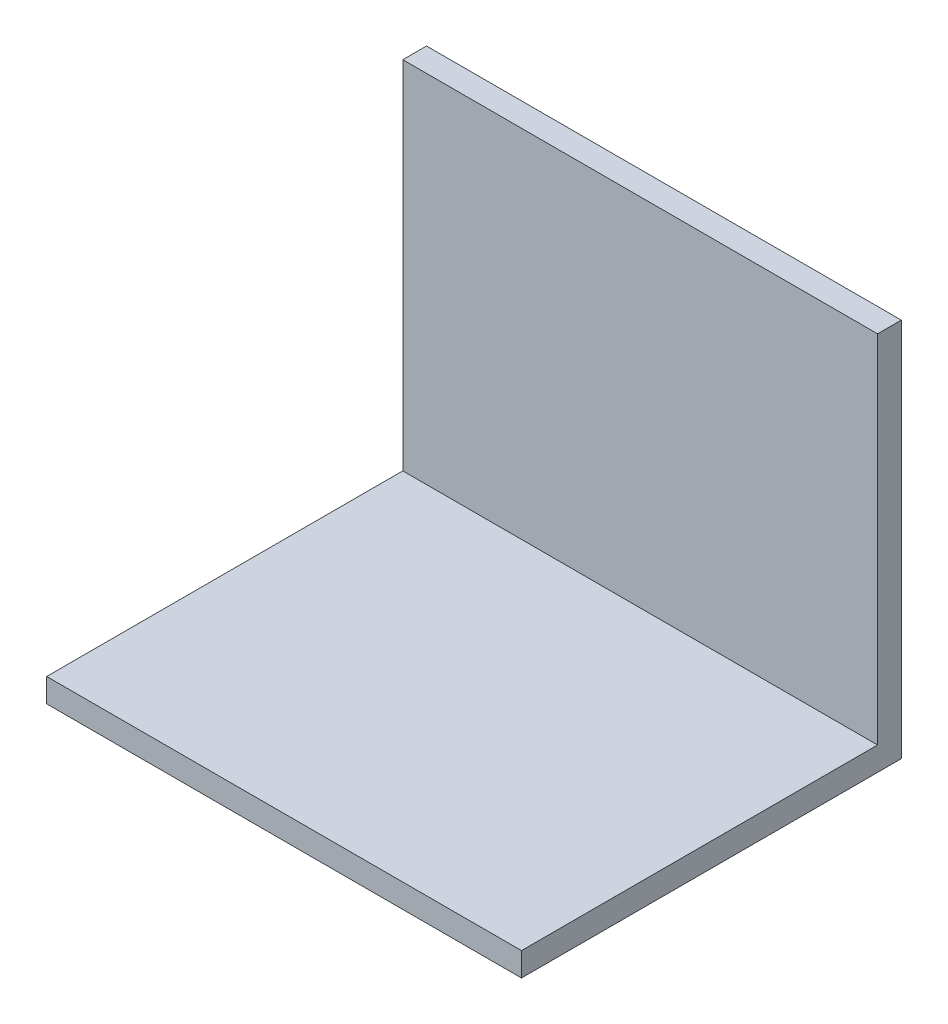
ISO-10303-21;
HEADER;
FILE_DESCRIPTION(('STEP AP214'),'2;1');
FILE_NAME('part.step','',(''),(''),'','','');
FILE_SCHEMA(('AUTOMOTIVE_DESIGN { 1 0 10303 214 1 1 1 1 }'));
ENDSEC;
DATA;
#1=APPLICATION_CONTEXT('core data for automotive mechanical design processes');
#2=APPLICATION_PROTOCOL_DEFINITION('international standard','automotive_design',2000,#1);
#3=PRODUCT_CONTEXT('',#1,'mechanical');
#4=PRODUCT('Part','Part','',(#3));
#5=PRODUCT_RELATED_PRODUCT_CATEGORY('part','',(#4));
#6=PRODUCT_DEFINITION_FORMATION('','',#4);
#7=PRODUCT_DEFINITION_CONTEXT('part definition',#1,'design');
#8=PRODUCT_DEFINITION('design','',#6,#7);
#9=PRODUCT_DEFINITION_SHAPE('','',#8);
#10=(LENGTH_UNIT() NAMED_UNIT(*) SI_UNIT(.MILLI.,.METRE.));
#11=(NAMED_UNIT(*) PLANE_ANGLE_UNIT() SI_UNIT($,.RADIAN.));
#12=(NAMED_UNIT(*) SI_UNIT($,.STERADIAN.) SOLID_ANGLE_UNIT());
#13=UNCERTAINTY_MEASURE_WITH_UNIT(LENGTH_MEASURE(1.E-05),#10,'distance_accuracy_value','');
#14=(GEOMETRIC_REPRESENTATION_CONTEXT(3) GLOBAL_UNCERTAINTY_ASSIGNED_CONTEXT((#13)) GLOBAL_UNIT_ASSIGNED_CONTEXT((#10,
#11,#12)) REPRESENTATION_CONTEXT('',''));
#15=CARTESIAN_POINT('',(0.,0.,0.));
#16=DIRECTION('',(0.,0.,1.));
#17=DIRECTION('',(1.,0.,0.));
#18=AXIS2_PLACEMENT_3D('',#15,#16,#17);
#19=CARTESIAN_POINT('',(127.,0.,0.));
#20=DIRECTION('',(0.,0.,1.));
#21=DIRECTION('',(1.,0.,0.));
#22=AXIS2_PLACEMENT_3D('',#19,#20,#21);
#23=PLANE('',#22);
#24=DIRECTION('',(0.,1.,0.));
#25=VECTOR('',#24,1.);
#26=CARTESIAN_POINT('',(0.,0.,0.));
#27=LINE('',#26,#25);
#28=CARTESIAN_POINT('',(0.,0.,0.));
#29=VERTEX_POINT('',#28);
#30=CARTESIAN_POINT('',(0.,101.6,0.));
#31=VERTEX_POINT('',#30);
#32=EDGE_CURVE('E118',#29,#31,#27,.T.);
#33=ORIENTED_EDGE('',*,*,#32,.T.);
#34=DIRECTION('',(-1.,0.,0.));
#35=VECTOR('',#34,1.);
#36=CARTESIAN_POINT('',(127.,101.6,0.));
#37=LINE('',#36,#35);
#38=CARTESIAN_POINT('',(127.,101.6,0.));
#39=VERTEX_POINT('',#38);
#40=EDGE_CURVE('E11',#39,#31,#37,.T.);
#41=ORIENTED_EDGE('',*,*,#40,.F.);
#42=DIRECTION('',(0.,1.,0.));
#43=VECTOR('',#42,1.);
#44=CARTESIAN_POINT('',(127.,0.,0.));
#45=LINE('',#44,#43);
#46=CARTESIAN_POINT('',(127.,0.,0.));
#47=VERTEX_POINT('',#46);
#48=EDGE_CURVE('E128',#47,#39,#45,.T.);
#49=ORIENTED_EDGE('',*,*,#48,.F.);
#50=DIRECTION('',(-1.,0.,0.));
#51=VECTOR('',#50,1.);
#52=CARTESIAN_POINT('',(127.,0.,0.));
#53=LINE('',#52,#51);
#54=EDGE_CURVE('E114',#47,#29,#53,.T.);
#55=ORIENTED_EDGE('',*,*,#54,.T.);
#56=EDGE_LOOP('',(#33,#41,#49,#55));
#57=FACE_BOUND('',#56,.T.);
#58=ADVANCED_FACE('F34',(#57),#23,.F.);
#59=CARTESIAN_POINT('',(127.,101.6,0.));
#60=DIRECTION('',(0.,-1.,0.));
#61=DIRECTION('',(0.,0.,-1.));
#62=AXIS2_PLACEMENT_3D('',#59,#60,#61);
#63=PLANE('',#62);
#64=DIRECTION('',(0.,0.,1.));
#65=VECTOR('',#64,1.);
#66=CARTESIAN_POINT('',(0.,101.6,0.));
#67=LINE('',#66,#65);
#68=CARTESIAN_POINT('',(0.,101.6,6.35));
#69=VERTEX_POINT('',#68);
#70=EDGE_CURVE('E121',#31,#69,#67,.T.);
#71=ORIENTED_EDGE('',*,*,#70,.T.);
#72=DIRECTION('',(-1.,0.,0.));
#73=VECTOR('',#72,1.);
#74=CARTESIAN_POINT('',(127.,101.6,6.35));
#75=LINE('',#74,#73);
#76=CARTESIAN_POINT('',(127.,101.6,6.35));
#77=VERTEX_POINT('',#76);
#78=EDGE_CURVE('E42',#77,#69,#75,.T.);
#79=ORIENTED_EDGE('',*,*,#78,.F.);
#80=DIRECTION('',(0.,0.,1.));
#81=VECTOR('',#80,1.);
#82=CARTESIAN_POINT('',(127.,101.6,0.));
#83=LINE('',#82,#81);
#84=EDGE_CURVE('E87',#39,#77,#83,.T.);
#85=ORIENTED_EDGE('',*,*,#84,.F.);
#86=ORIENTED_EDGE('',*,*,#40,.T.);
#87=EDGE_LOOP('',(#71,#79,#85,#86));
#88=FACE_BOUND('',#87,.T.);
#89=ADVANCED_FACE('F152',(#88),#63,.F.);
#90=CARTESIAN_POINT('',(127.,6.35,6.35));
#91=DIRECTION('',(0.,0.,-1.));
#92=DIRECTION('',(-1.,0.,0.));
#93=AXIS2_PLACEMENT_3D('',#90,#91,#92);
#94=PLANE('',#93);
#95=DIRECTION('',(0.,-1.,0.));
#96=VECTOR('',#95,1.);
#97=CARTESIAN_POINT('',(0.,6.35,6.35));
#98=LINE('',#97,#96);
#99=CARTESIAN_POINT('',(0.,6.35,6.35));
#100=VERTEX_POINT('',#99);
#101=EDGE_CURVE('E123',#69,#100,#98,.T.);
#102=ORIENTED_EDGE('',*,*,#101,.T.);
#103=DIRECTION('',(-1.,0.,0.));
#104=VECTOR('',#103,1.);
#105=CARTESIAN_POINT('',(127.,6.35,6.35));
#106=LINE('',#105,#104);
#107=CARTESIAN_POINT('',(127.,6.35,6.35));
#108=VERTEX_POINT('',#107);
#109=EDGE_CURVE('E109',#108,#100,#106,.T.);
#110=ORIENTED_EDGE('',*,*,#109,.F.);
#111=DIRECTION('',(0.,-1.,0.));
#112=VECTOR('',#111,1.);
#113=CARTESIAN_POINT('',(127.,6.35,6.35));
#114=LINE('',#113,#112);
#115=EDGE_CURVE('E100',#77,#108,#114,.T.);
#116=ORIENTED_EDGE('',*,*,#115,.F.);
#117=ORIENTED_EDGE('',*,*,#78,.T.);
#118=EDGE_LOOP('',(#102,#110,#116,#117));
#119=FACE_BOUND('',#118,.T.);
#120=ADVANCED_FACE('F134',(#119),#94,.F.);
#121=CARTESIAN_POINT('',(127.,6.35,6.35));
#122=DIRECTION('',(0.,-1.,0.));
#123=DIRECTION('',(0.,0.,-1.));
#124=AXIS2_PLACEMENT_3D('',#121,#122,#123);
#125=PLANE('',#124);
#126=DIRECTION('',(0.,0.,1.));
#127=VECTOR('',#126,1.);
#128=CARTESIAN_POINT('',(0.,6.35,6.35));
#129=LINE('',#128,#127);
#130=CARTESIAN_POINT('',(0.,6.34999999999999,101.6));
#131=VERTEX_POINT('',#130);
#132=EDGE_CURVE('E108',#100,#131,#129,.T.);
#133=ORIENTED_EDGE('',*,*,#132,.T.);
#134=DIRECTION('',(-1.,0.,0.));
#135=VECTOR('',#134,1.);
#136=CARTESIAN_POINT('',(127.,6.34999999999999,101.6));
#137=LINE('',#136,#135);
#138=CARTESIAN_POINT('',(127.,6.34999999999999,101.6));
#139=VERTEX_POINT('',#138);
#140=EDGE_CURVE('E105',#139,#131,#137,.T.);
#141=ORIENTED_EDGE('',*,*,#140,.F.);
#142=DIRECTION('',(0.,0.,1.));
#143=VECTOR('',#142,1.);
#144=CARTESIAN_POINT('',(127.,6.35,6.35));
#145=LINE('',#144,#143);
#146=EDGE_CURVE('E94',#108,#139,#145,.T.);
#147=ORIENTED_EDGE('',*,*,#146,.F.);
#148=ORIENTED_EDGE('',*,*,#109,.T.);
#149=EDGE_LOOP('',(#133,#141,#147,#148));
#150=FACE_BOUND('',#149,.T.);
#151=ADVANCED_FACE('F106',(#150),#125,.F.);
#152=CARTESIAN_POINT('',(127.,0.,101.6));
#153=DIRECTION('',(0.,0.,-1.));
#154=DIRECTION('',(-1.,0.,0.));
#155=AXIS2_PLACEMENT_3D('',#152,#153,#154);
#156=PLANE('',#155);
#157=DIRECTION('',(0.,-1.,0.));
#158=VECTOR('',#157,1.);
#159=CARTESIAN_POINT('',(0.,0.,101.6));
#160=LINE('',#159,#158);
#161=CARTESIAN_POINT('',(0.,0.,101.6));
#162=VERTEX_POINT('',#161);
#163=EDGE_CURVE('E73',#131,#162,#160,.T.);
#164=ORIENTED_EDGE('',*,*,#163,.T.);
#165=DIRECTION('',(-1.,0.,0.));
#166=VECTOR('',#165,1.);
#167=CARTESIAN_POINT('',(127.,0.,101.6));
#168=LINE('',#167,#166);
#169=CARTESIAN_POINT('',(127.,0.,101.6));
#170=VERTEX_POINT('',#169);
#171=EDGE_CURVE('E110',#170,#162,#168,.T.);
#172=ORIENTED_EDGE('',*,*,#171,.F.);
#173=DIRECTION('',(0.,-1.,0.));
#174=VECTOR('',#173,1.);
#175=CARTESIAN_POINT('',(127.,0.,101.6));
#176=LINE('',#175,#174);
#177=EDGE_CURVE('E98',#139,#170,#176,.T.);
#178=ORIENTED_EDGE('',*,*,#177,.F.);
#179=ORIENTED_EDGE('',*,*,#140,.T.);
#180=EDGE_LOOP('',(#164,#172,#178,#179));
#181=FACE_BOUND('',#180,.T.);
#182=ADVANCED_FACE('F112',(#181),#156,.F.);
#183=CARTESIAN_POINT('',(127.,0.,0.));
#184=DIRECTION('',(0.,1.,0.));
#185=DIRECTION('',(0.,0.,1.));
#186=AXIS2_PLACEMENT_3D('',#183,#184,#185);
#187=PLANE('',#186);
#188=DIRECTION('',(0.,0.,-1.));
#189=VECTOR('',#188,1.);
#190=CARTESIAN_POINT('',(0.,0.,0.));
#191=LINE('',#190,#189);
#192=EDGE_CURVE('E79',#162,#29,#191,.T.);
#193=ORIENTED_EDGE('',*,*,#192,.T.);
#194=ORIENTED_EDGE('',*,*,#54,.F.);
#195=DIRECTION('',(0.,0.,-1.));
#196=VECTOR('',#195,1.);
#197=CARTESIAN_POINT('',(127.,0.,0.));
#198=LINE('',#197,#196);
#199=EDGE_CURVE('E50',#170,#47,#198,.T.);
#200=ORIENTED_EDGE('',*,*,#199,.F.);
#201=ORIENTED_EDGE('',*,*,#171,.T.);
#202=EDGE_LOOP('',(#193,#194,#200,#201));
#203=FACE_BOUND('',#202,.T.);
#204=ADVANCED_FACE('F141',(#203),#187,.F.);
#205=CARTESIAN_POINT('',(127.,0.,0.));
#206=DIRECTION('',(1.,0.,0.));
#207=DIRECTION('',(0.,0.,-1.));
#208=AXIS2_PLACEMENT_3D('',#205,#206,#207);
#209=PLANE('',#208);
#210=ORIENTED_EDGE('',*,*,#48,.T.);
#211=ORIENTED_EDGE('',*,*,#84,.T.);
#212=ORIENTED_EDGE('',*,*,#115,.T.);
#213=ORIENTED_EDGE('',*,*,#146,.T.);
#214=ORIENTED_EDGE('',*,*,#177,.T.);
#215=ORIENTED_EDGE('',*,*,#199,.T.);
#216=EDGE_LOOP('',(#210,#211,#212,#213,#214,#215));
#217=FACE_BOUND('',#216,.T.);
#218=ADVANCED_FACE('F96',(#217),#209,.T.);
#219=CARTESIAN_POINT('',(0.,0.,0.));
#220=DIRECTION('',(1.,0.,0.));
#221=DIRECTION('',(0.,0.,-1.));
#222=AXIS2_PLACEMENT_3D('',#219,#220,#221);
#223=PLANE('',#222);
#224=ORIENTED_EDGE('',*,*,#32,.F.);
#225=ORIENTED_EDGE('',*,*,#192,.F.);
#226=ORIENTED_EDGE('',*,*,#163,.F.);
#227=ORIENTED_EDGE('',*,*,#132,.F.);
#228=ORIENTED_EDGE('',*,*,#101,.F.);
#229=ORIENTED_EDGE('',*,*,#70,.F.);
#230=EDGE_LOOP('',(#224,#225,#226,#227,#228,#229));
#231=FACE_BOUND('',#230,.T.);
#232=ADVANCED_FACE('F137',(#231),#223,.F.);
#233=CLOSED_SHELL('',(#58,#89,#120,#151,#182,#204,#218,#232));
#234=MANIFOLD_SOLID_BREP('B2',#233);
#235=ADVANCED_BREP_SHAPE_REPRESENTATION('',(#18,#234),#14);
#236=SHAPE_DEFINITION_REPRESENTATION(#9,#235);
ENDSEC;
END-ISO-10303-21;
